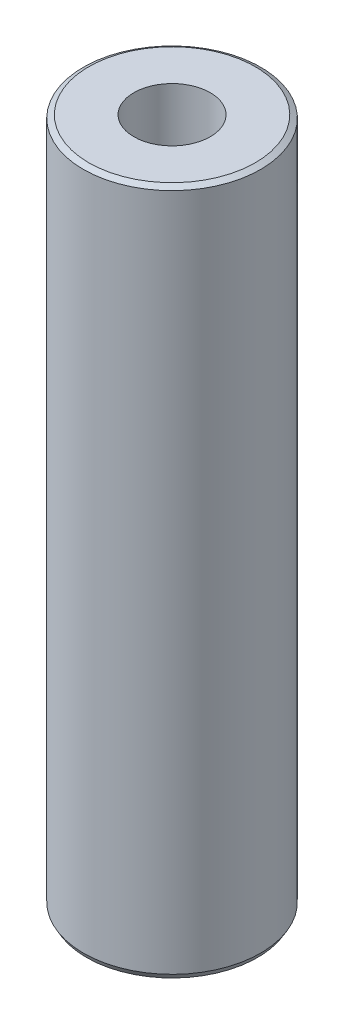
ISO-10303-21;
HEADER;
FILE_DESCRIPTION(('STEP AP214'),'2;1');
FILE_NAME('part.step','',(''),(''),'','','');
FILE_SCHEMA(('AUTOMOTIVE_DESIGN { 1 0 10303 214 1 1 1 1 }'));
ENDSEC;
DATA;
#1=APPLICATION_CONTEXT('core data for automotive mechanical design processes');
#2=APPLICATION_PROTOCOL_DEFINITION('international standard','automotive_design',2000,#1);
#3=PRODUCT_CONTEXT('',#1,'mechanical');
#4=PRODUCT('Part','Part','',(#3));
#5=PRODUCT_RELATED_PRODUCT_CATEGORY('part','',(#4));
#6=PRODUCT_DEFINITION_FORMATION('','',#4);
#7=PRODUCT_DEFINITION_CONTEXT('part definition',#1,'design');
#8=PRODUCT_DEFINITION('design','',#6,#7);
#9=PRODUCT_DEFINITION_SHAPE('','',#8);
#10=(LENGTH_UNIT() NAMED_UNIT(*) SI_UNIT(.MILLI.,.METRE.));
#11=(NAMED_UNIT(*) PLANE_ANGLE_UNIT() SI_UNIT($,.RADIAN.));
#12=(NAMED_UNIT(*) SI_UNIT($,.STERADIAN.) SOLID_ANGLE_UNIT());
#13=UNCERTAINTY_MEASURE_WITH_UNIT(LENGTH_MEASURE(1.E-05),#10,'distance_accuracy_value','');
#14=(GEOMETRIC_REPRESENTATION_CONTEXT(3) GLOBAL_UNCERTAINTY_ASSIGNED_CONTEXT((#13)) GLOBAL_UNIT_ASSIGNED_CONTEXT((#10,
#11,#12)) REPRESENTATION_CONTEXT('',''));
#15=CARTESIAN_POINT('',(0.,0.,0.));
#16=DIRECTION('',(0.,0.,1.));
#17=DIRECTION('',(1.,0.,0.));
#18=AXIS2_PLACEMENT_3D('',#15,#16,#17);
#19=CARTESIAN_POINT('',(0.,445.852321358295,0.));
#20=DIRECTION('',(0.,-1.,0.));
#21=DIRECTION('',(0.,0.,-1.));
#22=AXIS2_PLACEMENT_3D('',#19,#20,#21);
#23=CYLINDRICAL_SURFACE('',#22,57.5);
#24=CARTESIAN_POINT('',(0.,443.842144094404,0.));
#25=DIRECTION('',(0.,1.,0.));
#26=DIRECTION('',(0.,0.,1.));
#27=AXIS2_PLACEMENT_3D('',#24,#25,#26);
#28=CIRCLE('',#27,57.5);
#29=CARTESIAN_POINT('',(0.,443.842144094404,57.5));
#30=VERTEX_POINT('',#29);
#31=EDGE_CURVE('E50',#30,#30,#28,.F.);
#32=ORIENTED_EDGE('',*,*,#31,.T.);
#33=EDGE_LOOP('',(#32));
#34=FACE_BOUND('',#33,.T.);
#35=CARTESIAN_POINT('',(0.,3.48172915327882,0.));
#36=DIRECTION('',(0.,1.,0.));
#37=DIRECTION('',(0.,0.,1.));
#38=AXIS2_PLACEMENT_3D('',#35,#36,#37);
#39=CIRCLE('',#38,57.5);
#40=CARTESIAN_POINT('',(0.,3.48172915327882,57.5));
#41=VERTEX_POINT('',#40);
#42=EDGE_CURVE('E51',#41,#41,#39,.T.);
#43=ORIENTED_EDGE('',*,*,#42,.T.);
#44=EDGE_LOOP('',(#43));
#45=FACE_BOUND('',#44,.T.);
#46=ADVANCED_FACE('F39',(#34,#45),#23,.T.);
#47=CARTESIAN_POINT('',(0.,445.852321358295,0.));
#48=DIRECTION('',(0.,1.,0.));
#49=DIRECTION('',(0.,0.,1.));
#50=AXIS2_PLACEMENT_3D('',#47,#48,#49);
#51=PLANE('',#50);
#52=CARTESIAN_POINT('',(0.,445.852321358295,0.));
#53=DIRECTION('',(0.,1.,0.));
#54=DIRECTION('',(0.,0.,1.));
#55=AXIS2_PLACEMENT_3D('',#52,#53,#54);
#56=CIRCLE('',#55,54.0182708467212);
#57=CARTESIAN_POINT('',(0.,445.852321358295,54.0182708467212));
#58=VERTEX_POINT('',#57);
#59=EDGE_CURVE('E54',#58,#58,#56,.T.);
#60=ORIENTED_EDGE('',*,*,#59,.T.);
#61=EDGE_LOOP('',(#60));
#62=FACE_BOUND('',#61,.T.);
#63=CARTESIAN_POINT('',(0.,445.852321358295,0.));
#64=DIRECTION('',(0.,1.,0.));
#65=DIRECTION('',(0.,0.,1.));
#66=AXIS2_PLACEMENT_3D('',#63,#64,#65);
#67=CIRCLE('',#66,24.7828219178732);
#68=CARTESIAN_POINT('',(0.,445.852321358295,24.7828219178732));
#69=VERTEX_POINT('',#68);
#70=EDGE_CURVE('E58',#69,#69,#67,.T.);
#71=ORIENTED_EDGE('',*,*,#70,.F.);
#72=EDGE_LOOP('',(#71));
#73=FACE_BOUND('',#72,.T.);
#74=ADVANCED_FACE('F69',(#62,#73),#51,.T.);
#75=CARTESIAN_POINT('',(0.,0.,0.));
#76=DIRECTION('',(0.,1.,0.));
#77=DIRECTION('',(0.,0.,1.));
#78=AXIS2_PLACEMENT_3D('',#75,#76,#77);
#79=PLANE('',#78);
#80=CARTESIAN_POINT('',(0.,0.,0.));
#81=DIRECTION('',(0.,1.,0.));
#82=DIRECTION('',(0.,0.,1.));
#83=AXIS2_PLACEMENT_3D('',#80,#81,#82);
#84=CIRCLE('',#83,55.4898227361091);
#85=CARTESIAN_POINT('',(0.,0.,55.4898227361091));
#86=VERTEX_POINT('',#85);
#87=EDGE_CURVE('E10',#86,#86,#84,.F.);
#88=ORIENTED_EDGE('',*,*,#87,.T.);
#89=EDGE_LOOP('',(#88));
#90=FACE_BOUND('',#89,.T.);
#91=CARTESIAN_POINT('',(0.,0.,0.));
#92=DIRECTION('',(0.,1.,0.));
#93=DIRECTION('',(0.,0.,1.));
#94=AXIS2_PLACEMENT_3D('',#91,#92,#93);
#95=CIRCLE('',#94,24.7828219178732);
#96=CARTESIAN_POINT('',(0.,0.,24.7828219178732));
#97=VERTEX_POINT('',#96);
#98=EDGE_CURVE('E63',#97,#97,#95,.T.);
#99=ORIENTED_EDGE('',*,*,#98,.T.);
#100=EDGE_LOOP('',(#99));
#101=FACE_BOUND('',#100,.T.);
#102=ADVANCED_FACE('F75',(#90,#101),#79,.F.);
#103=CARTESIAN_POINT('',(0.,445.852321358295,0.));
#104=DIRECTION('',(0.,-1.,0.));
#105=DIRECTION('',(0.,0.,-1.));
#106=AXIS2_PLACEMENT_3D('',#103,#104,#105);
#107=CYLINDRICAL_SURFACE('',#106,24.7828219178732);
#108=ORIENTED_EDGE('',*,*,#70,.T.);
#109=EDGE_LOOP('',(#108));
#110=FACE_BOUND('',#109,.T.);
#111=ORIENTED_EDGE('',*,*,#98,.F.);
#112=EDGE_LOOP('',(#111));
#113=FACE_BOUND('',#112,.T.);
#114=ADVANCED_FACE('F70',(#110,#113),#107,.F.);
#115=CARTESIAN_POINT('',(0.,445.852321358295,0.));
#116=DIRECTION('',(0.,-1.,0.));
#117=DIRECTION('',(0.,0.,-1.));
#118=AXIS2_PLACEMENT_3D('',#115,#116,#117);
#119=CONICAL_SURFACE('',#118,54.0182708467212,1.04719755119658);
#120=ORIENTED_EDGE('',*,*,#31,.F.);
#121=EDGE_LOOP('',(#120));
#122=FACE_BOUND('',#121,.T.);
#123=ORIENTED_EDGE('',*,*,#59,.F.);
#124=EDGE_LOOP('',(#123));
#125=FACE_BOUND('',#124,.T.);
#126=ADVANCED_FACE('F81',(#122,#125),#119,.T.);
#127=CARTESIAN_POINT('',(0.,3.48172915327882,0.));
#128=DIRECTION('',(0.,1.,0.));
#129=DIRECTION('',(0.,0.,1.));
#130=AXIS2_PLACEMENT_3D('',#127,#128,#129);
#131=CONICAL_SURFACE('',#130,57.5,0.52359877559831);
#132=ORIENTED_EDGE('',*,*,#87,.F.);
#133=EDGE_LOOP('',(#132));
#134=FACE_BOUND('',#133,.T.);
#135=ORIENTED_EDGE('',*,*,#42,.F.);
#136=EDGE_LOOP('',(#135));
#137=FACE_BOUND('',#136,.T.);
#138=ADVANCED_FACE('F45',(#134,#137),#131,.T.);
#139=CLOSED_SHELL('',(#46,#74,#102,#114,#126,#138));
#140=MANIFOLD_SOLID_BREP('B2',#139);
#141=ADVANCED_BREP_SHAPE_REPRESENTATION('',(#18,#140),#14);
#142=SHAPE_DEFINITION_REPRESENTATION(#9,#141);
ENDSEC;
END-ISO-10303-21;
